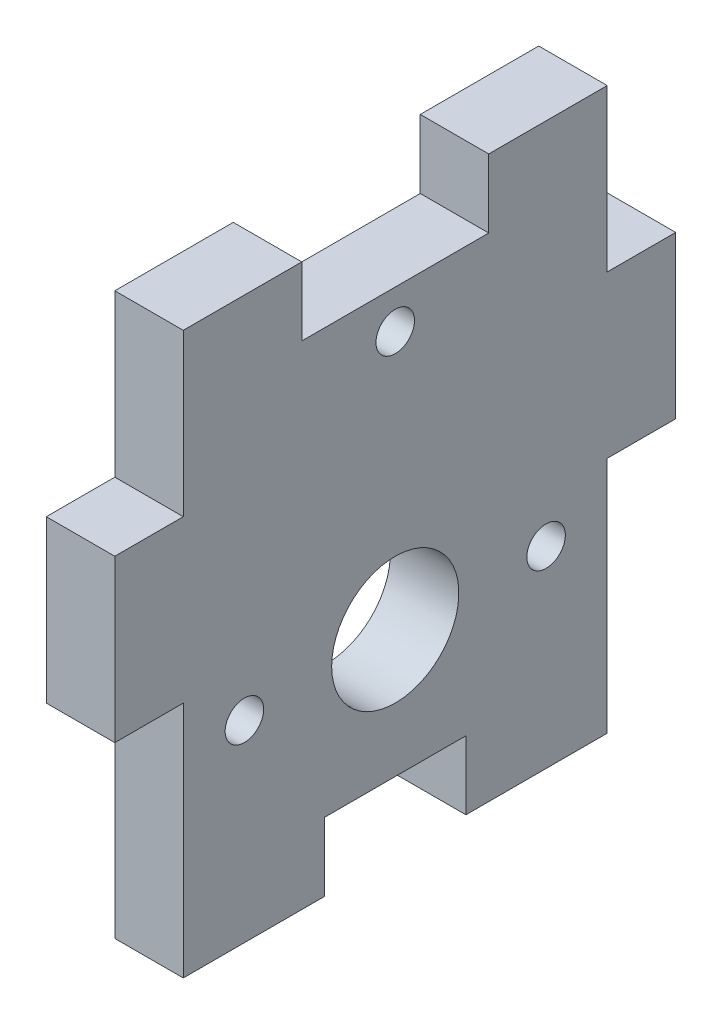
ISO-10303-21;
HEADER;
FILE_DESCRIPTION(('STEP AP214'),'2;1');
FILE_NAME('part.step','',(''),(''),'','','');
FILE_SCHEMA(('AUTOMOTIVE_DESIGN { 1 0 10303 214 1 1 1 1 }'));
ENDSEC;
DATA;
#1=APPLICATION_CONTEXT('core data for automotive mechanical design processes');
#2=APPLICATION_PROTOCOL_DEFINITION('international standard','automotive_design',2000,#1);
#3=PRODUCT_CONTEXT('',#1,'mechanical');
#4=PRODUCT('Part','Part','',(#3));
#5=PRODUCT_RELATED_PRODUCT_CATEGORY('part','',(#4));
#6=PRODUCT_DEFINITION_FORMATION('','',#4);
#7=PRODUCT_DEFINITION_CONTEXT('part definition',#1,'design');
#8=PRODUCT_DEFINITION('design','',#6,#7);
#9=PRODUCT_DEFINITION_SHAPE('','',#8);
#10=(LENGTH_UNIT() NAMED_UNIT(*) SI_UNIT(.MILLI.,.METRE.));
#11=(NAMED_UNIT(*) PLANE_ANGLE_UNIT() SI_UNIT($,.RADIAN.));
#12=(NAMED_UNIT(*) SI_UNIT($,.STERADIAN.) SOLID_ANGLE_UNIT());
#13=UNCERTAINTY_MEASURE_WITH_UNIT(LENGTH_MEASURE(1.E-05),#10,'distance_accuracy_value','');
#14=(GEOMETRIC_REPRESENTATION_CONTEXT(3) GLOBAL_UNCERTAINTY_ASSIGNED_CONTEXT((#13)) GLOBAL_UNIT_ASSIGNED_CONTEXT((#10,
#11,#12)) REPRESENTATION_CONTEXT('',''));
#15=CARTESIAN_POINT('',(0.,0.,0.));
#16=DIRECTION('',(0.,0.,1.));
#17=DIRECTION('',(1.,0.,0.));
#18=AXIS2_PLACEMENT_3D('',#15,#16,#17);
#19=CARTESIAN_POINT('',(5.334,16.51,-16.51));
#20=DIRECTION('',(-1.,0.,0.));
#21=DIRECTION('',(0.,0.,1.));
#22=AXIS2_PLACEMENT_3D('',#19,#20,#21);
#23=PLANE('',#22);
#24=CARTESIAN_POINT('',(5.334,-6.84159698893423,-11.7499999999999));
#25=DIRECTION('',(-1.,0.,0.));
#26=DIRECTION('',(0.,0.,1.));
#27=AXIS2_PLACEMENT_3D('',#24,#25,#26);
#28=CIRCLE('',#27,1.5);
#29=CARTESIAN_POINT('',(5.334,-6.84159698893423,-10.2499999999999));
#30=VERTEX_POINT('',#29);
#31=EDGE_CURVE('E540',#30,#30,#28,.T.);
#32=ORIENTED_EDGE('',*,*,#31,.T.);
#33=EDGE_LOOP('',(#32));
#34=FACE_BOUND('',#33,.T.);
#35=CARTESIAN_POINT('',(5.334,-6.60399999999997,0.));
#36=DIRECTION('',(-1.,0.,0.));
#37=DIRECTION('',(0.,0.,1.));
#38=AXIS2_PLACEMENT_3D('',#35,#36,#37);
#39=CIRCLE('',#38,4.953);
#40=CARTESIAN_POINT('',(5.334,-6.60399999999997,4.95300000000006));
#41=VERTEX_POINT('',#40);
#42=EDGE_CURVE('E544',#41,#41,#39,.T.);
#43=ORIENTED_EDGE('',*,*,#42,.T.);
#44=EDGE_LOOP('',(#43));
#45=FACE_BOUND('',#44,.T.);
#46=CARTESIAN_POINT('',(5.334,-6.84159698893422,11.7500000000001));
#47=DIRECTION('',(-1.,0.,0.));
#48=DIRECTION('',(0.,0.,1.));
#49=AXIS2_PLACEMENT_3D('',#46,#47,#48);
#50=CIRCLE('',#49,1.5);
#51=CARTESIAN_POINT('',(5.334,-6.84159698893422,13.2500000000001));
#52=VERTEX_POINT('',#51);
#53=EDGE_CURVE('E553',#52,#52,#50,.T.);
#54=ORIENTED_EDGE('',*,*,#53,.T.);
#55=EDGE_LOOP('',(#54));
#56=FACE_BOUND('',#55,.T.);
#57=CARTESIAN_POINT('',(5.334,13.5100000000001,0.));
#58=DIRECTION('',(-1.,0.,0.));
#59=DIRECTION('',(0.,0.,1.));
#60=AXIS2_PLACEMENT_3D('',#57,#58,#59);
#61=CIRCLE('',#60,1.5);
#62=CARTESIAN_POINT('',(5.334,13.5100000000001,1.50000000000006));
#63=VERTEX_POINT('',#62);
#64=EDGE_CURVE('E231',#63,#63,#61,.T.);
#65=ORIENTED_EDGE('',*,*,#64,.T.);
#66=EDGE_LOOP('',(#65));
#67=FACE_BOUND('',#66,.T.);
#68=DIRECTION('',(0.,0.,-1.));
#69=VECTOR('',#68,1.);
#70=CARTESIAN_POINT('',(5.33400000000003,16.51,7.28133333333334));
#71=LINE('',#70,#69);
#72=CARTESIAN_POINT('',(5.33400000000003,16.51,7.28133333333334));
#73=VERTEX_POINT('',#72);
#74=CARTESIAN_POINT('',(5.33400000000002,16.51,-7.28133333333333));
#75=VERTEX_POINT('',#74);
#76=EDGE_CURVE('E274',#73,#75,#71,.T.);
#77=ORIENTED_EDGE('',*,*,#76,.F.);
#78=DIRECTION('',(0.,1.,0.));
#79=VECTOR('',#78,1.);
#80=CARTESIAN_POINT('',(5.33400000000003,16.51,7.28133333333334));
#81=LINE('',#80,#79);
#82=CARTESIAN_POINT('',(5.33400000000003,21.844,7.28133333333334));
#83=VERTEX_POINT('',#82);
#84=EDGE_CURVE('E299',#73,#83,#81,.T.);
#85=ORIENTED_EDGE('',*,*,#84,.T.);
#86=DIRECTION('',(0.,0.,1.));
#87=VECTOR('',#86,1.);
#88=CARTESIAN_POINT('',(5.334,21.844,-48.1982213562373));
#89=LINE('',#88,#87);
#90=CARTESIAN_POINT('',(5.334,21.844,16.51));
#91=VERTEX_POINT('',#90);
#92=EDGE_CURVE('E370',#83,#91,#89,.T.);
#93=ORIENTED_EDGE('',*,*,#92,.T.);
#94=DIRECTION('',(0.,1.,0.));
#95=VECTOR('',#94,1.);
#96=CARTESIAN_POINT('',(5.334,-15.875,16.51));
#97=LINE('',#96,#95);
#98=CARTESIAN_POINT('',(5.334,9.271,16.51));
#99=VERTEX_POINT('',#98);
#100=EDGE_CURVE('E89',#99,#91,#97,.T.);
#101=ORIENTED_EDGE('',*,*,#100,.F.);
#102=DIRECTION('',(0.,0.,1.));
#103=VECTOR('',#102,1.);
#104=CARTESIAN_POINT('',(5.334,9.271,16.51));
#105=LINE('',#104,#103);
#106=CARTESIAN_POINT('',(5.334,9.271,21.844));
#107=VERTEX_POINT('',#106);
#108=EDGE_CURVE('E238',#99,#107,#105,.T.);
#109=ORIENTED_EDGE('',*,*,#108,.T.);
#110=DIRECTION('',(0.,1.,0.));
#111=VECTOR('',#110,1.);
#112=CARTESIAN_POINT('',(5.334,0.,21.844));
#113=LINE('',#112,#111);
#114=CARTESIAN_POINT('',(5.334,-3.302,21.844));
#115=VERTEX_POINT('',#114);
#116=EDGE_CURVE('E237',#115,#107,#113,.T.);
#117=ORIENTED_EDGE('',*,*,#116,.F.);
#118=DIRECTION('',(0.,0.,-1.));
#119=VECTOR('',#118,1.);
#120=CARTESIAN_POINT('',(5.334,-3.302,16.51));
#121=LINE('',#120,#119);
#122=CARTESIAN_POINT('',(5.334,-3.302,16.51));
#123=VERTEX_POINT('',#122);
#124=EDGE_CURVE('E226',#115,#123,#121,.T.);
#125=ORIENTED_EDGE('',*,*,#124,.T.);
#126=DIRECTION('',(0.,-1.,0.));
#127=VECTOR('',#126,1.);
#128=CARTESIAN_POINT('',(5.334,0.,16.51));
#129=LINE('',#128,#127);
#130=CARTESIAN_POINT('',(5.334,-21.844,16.51));
#131=VERTEX_POINT('',#130);
#132=EDGE_CURVE('E210',#123,#131,#129,.T.);
#133=ORIENTED_EDGE('',*,*,#132,.T.);
#134=DIRECTION('',(0.,0.,-1.));
#135=VECTOR('',#134,1.);
#136=CARTESIAN_POINT('',(5.334,-21.844,-48.1982213562373));
#137=LINE('',#136,#135);
#138=CARTESIAN_POINT('',(5.334,-21.844,5.50333333333335));
#139=VERTEX_POINT('',#138);
#140=EDGE_CURVE('E330',#131,#139,#137,.T.);
#141=ORIENTED_EDGE('',*,*,#140,.T.);
#142=DIRECTION('',(0.,-1.,0.));
#143=VECTOR('',#142,1.);
#144=CARTESIAN_POINT('',(5.334,-21.844,5.50333333333335));
#145=LINE('',#144,#143);
#146=CARTESIAN_POINT('',(5.334,-16.51,5.50333333333335));
#147=VERTEX_POINT('',#146);
#148=EDGE_CURVE('E307',#147,#139,#145,.T.);
#149=ORIENTED_EDGE('',*,*,#148,.F.);
#150=DIRECTION('',(0.,0.,1.));
#151=VECTOR('',#150,1.);
#152=CARTESIAN_POINT('',(5.334,-16.51,5.50333333333335));
#153=LINE('',#152,#151);
#154=CARTESIAN_POINT('',(5.334,-16.51,-5.50333333333332));
#155=VERTEX_POINT('',#154);
#156=EDGE_CURVE('E312',#155,#147,#153,.T.);
#157=ORIENTED_EDGE('',*,*,#156,.F.);
#158=DIRECTION('',(0.,1.,0.));
#159=VECTOR('',#158,1.);
#160=CARTESIAN_POINT('',(5.334,-21.844,-5.50333333333332));
#161=LINE('',#160,#159);
#162=CARTESIAN_POINT('',(5.334,-21.844,-5.50333333333332));
#163=VERTEX_POINT('',#162);
#164=EDGE_CURVE('E309',#163,#155,#161,.T.);
#165=ORIENTED_EDGE('',*,*,#164,.F.);
#166=CARTESIAN_POINT('',(5.334,-21.844,-16.51));
#167=VERTEX_POINT('',#166);
#168=EDGE_CURVE('E220',#163,#167,#137,.T.);
#169=ORIENTED_EDGE('',*,*,#168,.T.);
#170=DIRECTION('',(0.,-1.,0.));
#171=VECTOR('',#170,1.);
#172=CARTESIAN_POINT('',(5.334,0.,-16.51));
#173=LINE('',#172,#171);
#174=CARTESIAN_POINT('',(5.33399999999999,-3.30200000000001,-16.51));
#175=VERTEX_POINT('',#174);
#176=EDGE_CURVE('E323',#175,#167,#173,.T.);
#177=ORIENTED_EDGE('',*,*,#176,.F.);
#178=DIRECTION('',(0.,0.,-1.));
#179=VECTOR('',#178,1.);
#180=CARTESIAN_POINT('',(5.33399999999999,-3.30200000000001,-21.844));
#181=LINE('',#180,#179);
#182=CARTESIAN_POINT('',(5.33399999999999,-3.30200000000001,-21.844));
#183=VERTEX_POINT('',#182);
#184=EDGE_CURVE('E267',#175,#183,#181,.T.);
#185=ORIENTED_EDGE('',*,*,#184,.T.);
#186=DIRECTION('',(0.,-1.,0.));
#187=VECTOR('',#186,1.);
#188=CARTESIAN_POINT('',(5.334,0.,-21.844));
#189=LINE('',#188,#187);
#190=CARTESIAN_POINT('',(5.334,9.27099999999999,-21.844));
#191=VERTEX_POINT('',#190);
#192=EDGE_CURVE('E332',#191,#183,#189,.T.);
#193=ORIENTED_EDGE('',*,*,#192,.F.);
#194=DIRECTION('',(0.,0.,1.));
#195=VECTOR('',#194,1.);
#196=CARTESIAN_POINT('',(5.33399999999999,9.27099999999999,-21.844));
#197=LINE('',#196,#195);
#198=CARTESIAN_POINT('',(5.33399999999999,9.27099999999999,-16.51));
#199=VERTEX_POINT('',#198);
#200=EDGE_CURVE('E270',#191,#199,#197,.T.);
#201=ORIENTED_EDGE('',*,*,#200,.T.);
#202=DIRECTION('',(0.,1.,0.));
#203=VECTOR('',#202,1.);
#204=CARTESIAN_POINT('',(5.33399999999999,-15.875,-16.51));
#205=LINE('',#204,#203);
#206=CARTESIAN_POINT('',(5.33399999999998,21.844,-16.51));
#207=VERTEX_POINT('',#206);
#208=EDGE_CURVE('E261',#199,#207,#205,.T.);
#209=ORIENTED_EDGE('',*,*,#208,.T.);
#210=CARTESIAN_POINT('',(5.334,21.844,-7.28133333333333));
#211=VERTEX_POINT('',#210);
#212=EDGE_CURVE('E369',#207,#211,#89,.T.);
#213=ORIENTED_EDGE('',*,*,#212,.T.);
#214=DIRECTION('',(0.,1.,0.));
#215=VECTOR('',#214,1.);
#216=CARTESIAN_POINT('',(5.33400000000002,16.51,-7.28133333333333));
#217=LINE('',#216,#215);
#218=EDGE_CURVE('E97',#75,#211,#217,.T.);
#219=ORIENTED_EDGE('',*,*,#218,.F.);
#220=EDGE_LOOP('',(#77,#85,#93,#101,#109,#117,#125,#133,#141,#149,#157,#165,#169,#177,#185,#193,
#201,#209,#213,#219));
#221=FACE_BOUND('',#220,.T.);
#222=ADVANCED_FACE('F73',(#34,#45,#56,#67,#221),#23,.F.);
#223=CARTESIAN_POINT('',(0.,16.51,-16.51));
#224=DIRECTION('',(-1.,0.,0.));
#225=DIRECTION('',(0.,0.,1.));
#226=AXIS2_PLACEMENT_3D('',#223,#224,#225);
#227=PLANE('',#226);
#228=CARTESIAN_POINT('',(0.,-6.84159698893423,-11.7499999999999));
#229=DIRECTION('',(-1.,0.,0.));
#230=DIRECTION('',(0.,0.,1.));
#231=AXIS2_PLACEMENT_3D('',#228,#229,#230);
#232=CIRCLE('',#231,1.5);
#233=CARTESIAN_POINT('',(0.,-6.84159698893423,-10.2499999999999));
#234=VERTEX_POINT('',#233);
#235=EDGE_CURVE('E538',#234,#234,#232,.T.);
#236=ORIENTED_EDGE('',*,*,#235,.F.);
#237=EDGE_LOOP('',(#236));
#238=FACE_BOUND('',#237,.T.);
#239=CARTESIAN_POINT('',(0.,-6.60399999999997,0.));
#240=DIRECTION('',(-1.,0.,0.));
#241=DIRECTION('',(0.,0.,1.));
#242=AXIS2_PLACEMENT_3D('',#239,#240,#241);
#243=CIRCLE('',#242,4.953);
#244=CARTESIAN_POINT('',(0.,-6.60399999999997,4.95300000000006));
#245=VERTEX_POINT('',#244);
#246=EDGE_CURVE('E541',#245,#245,#243,.T.);
#247=ORIENTED_EDGE('',*,*,#246,.F.);
#248=EDGE_LOOP('',(#247));
#249=FACE_BOUND('',#248,.T.);
#250=CARTESIAN_POINT('',(0.,-6.84159698893422,11.7500000000001));
#251=DIRECTION('',(-1.,0.,0.));
#252=DIRECTION('',(0.,0.,1.));
#253=AXIS2_PLACEMENT_3D('',#250,#251,#252);
#254=CIRCLE('',#253,1.5);
#255=CARTESIAN_POINT('',(0.,-6.84159698893422,13.2500000000001));
#256=VERTEX_POINT('',#255);
#257=EDGE_CURVE('E550',#256,#256,#254,.T.);
#258=ORIENTED_EDGE('',*,*,#257,.F.);
#259=EDGE_LOOP('',(#258));
#260=FACE_BOUND('',#259,.T.);
#261=CARTESIAN_POINT('',(0.,13.5100000000001,0.));
#262=DIRECTION('',(-1.,0.,0.));
#263=DIRECTION('',(0.,0.,1.));
#264=AXIS2_PLACEMENT_3D('',#261,#262,#263);
#265=CIRCLE('',#264,1.5);
#266=CARTESIAN_POINT('',(0.,13.5100000000001,1.50000000000006));
#267=VERTEX_POINT('',#266);
#268=EDGE_CURVE('E556',#267,#267,#265,.T.);
#269=ORIENTED_EDGE('',*,*,#268,.F.);
#270=EDGE_LOOP('',(#269));
#271=FACE_BOUND('',#270,.T.);
#272=DIRECTION('',(0.,1.,0.));
#273=VECTOR('',#272,1.);
#274=CARTESIAN_POINT('',(0.,0.,21.844));
#275=LINE('',#274,#273);
#276=CARTESIAN_POINT('',(0.,-3.30200000000001,21.844));
#277=VERTEX_POINT('',#276);
#278=CARTESIAN_POINT('',(0.,9.27099999999999,21.844));
#279=VERTEX_POINT('',#278);
#280=EDGE_CURVE('E342',#277,#279,#275,.T.);
#281=ORIENTED_EDGE('',*,*,#280,.T.);
#282=DIRECTION('',(0.,0.,-1.));
#283=VECTOR('',#282,1.);
#284=CARTESIAN_POINT('',(0.,9.27099999999999,21.84405));
#285=LINE('',#284,#283);
#286=CARTESIAN_POINT('',(0.,9.27099999999999,16.51));
#287=VERTEX_POINT('',#286);
#288=EDGE_CURVE('E421',#279,#287,#285,.T.);
#289=ORIENTED_EDGE('',*,*,#288,.T.);
#290=DIRECTION('',(0.,-1.,0.));
#291=VECTOR('',#290,1.);
#292=CARTESIAN_POINT('',(0.,21.844,16.51));
#293=LINE('',#292,#291);
#294=CARTESIAN_POINT('',(0.,21.844,16.51));
#295=VERTEX_POINT('',#294);
#296=EDGE_CURVE('E287',#295,#287,#293,.T.);
#297=ORIENTED_EDGE('',*,*,#296,.F.);
#298=DIRECTION('',(0.,0.,1.));
#299=VECTOR('',#298,1.);
#300=CARTESIAN_POINT('',(0.,21.844,-48.1982213562373));
#301=LINE('',#300,#299);
#302=CARTESIAN_POINT('',(0.,21.844,7.28133333333334));
#303=VERTEX_POINT('',#302);
#304=EDGE_CURVE('E339',#303,#295,#301,.T.);
#305=ORIENTED_EDGE('',*,*,#304,.F.);
#306=DIRECTION('',(0.,1.,0.));
#307=VECTOR('',#306,1.);
#308=CARTESIAN_POINT('',(0.,16.51,7.28133333333334));
#309=LINE('',#308,#307);
#310=CARTESIAN_POINT('',(0.,16.51,7.28133333333334));
#311=VERTEX_POINT('',#310);
#312=EDGE_CURVE('E284',#311,#303,#309,.T.);
#313=ORIENTED_EDGE('',*,*,#312,.F.);
#314=DIRECTION('',(0.,0.,1.));
#315=VECTOR('',#314,1.);
#316=CARTESIAN_POINT('',(0.,16.51,-16.51));
#317=LINE('',#316,#315);
#318=CARTESIAN_POINT('',(0.,16.51,-7.28133333333333));
#319=VERTEX_POINT('',#318);
#320=EDGE_CURVE('E12',#319,#311,#317,.T.);
#321=ORIENTED_EDGE('',*,*,#320,.F.);
#322=DIRECTION('',(0.,1.,0.));
#323=VECTOR('',#322,1.);
#324=CARTESIAN_POINT('',(0.,16.51,-7.28133333333333));
#325=LINE('',#324,#323);
#326=CARTESIAN_POINT('',(0.,21.844,-7.28133333333333));
#327=VERTEX_POINT('',#326);
#328=EDGE_CURVE('E288',#319,#327,#325,.T.);
#329=ORIENTED_EDGE('',*,*,#328,.T.);
#330=CARTESIAN_POINT('',(0.,21.844,-16.51));
#331=VERTEX_POINT('',#330);
#332=EDGE_CURVE('E347',#331,#327,#301,.T.);
#333=ORIENTED_EDGE('',*,*,#332,.F.);
#334=DIRECTION('',(0.,1.,0.));
#335=VECTOR('',#334,1.);
#336=CARTESIAN_POINT('',(0.,16.51,-16.51));
#337=LINE('',#336,#335);
#338=CARTESIAN_POINT('',(0.,9.27099999999999,-16.51));
#339=VERTEX_POINT('',#338);
#340=EDGE_CURVE('E305',#339,#331,#337,.T.);
#341=ORIENTED_EDGE('',*,*,#340,.F.);
#342=DIRECTION('',(0.,0.,-1.));
#343=VECTOR('',#342,1.);
#344=CARTESIAN_POINT('',(0.,9.27099999999999,-16.50995));
#345=LINE('',#344,#343);
#346=CARTESIAN_POINT('',(0.,9.27099999999999,-21.844));
#347=VERTEX_POINT('',#346);
#348=EDGE_CURVE('E252',#339,#347,#345,.T.);
#349=ORIENTED_EDGE('',*,*,#348,.T.);
#350=DIRECTION('',(0.,-1.,0.));
#351=VECTOR('',#350,1.);
#352=CARTESIAN_POINT('',(0.,0.,-21.844));
#353=LINE('',#352,#351);
#354=CARTESIAN_POINT('',(0.,-3.30200000000001,-21.844));
#355=VERTEX_POINT('',#354);
#356=EDGE_CURVE('E336',#347,#355,#353,.T.);
#357=ORIENTED_EDGE('',*,*,#356,.T.);
#358=DIRECTION('',(0.,0.,-1.));
#359=VECTOR('',#358,1.);
#360=CARTESIAN_POINT('',(0.,-3.30200000000001,-16.50995));
#361=LINE('',#360,#359);
#362=CARTESIAN_POINT('',(0.,-3.30200000000001,-16.51));
#363=VERTEX_POINT('',#362);
#364=EDGE_CURVE('E251',#363,#355,#361,.T.);
#365=ORIENTED_EDGE('',*,*,#364,.F.);
#366=DIRECTION('',(0.,-1.,0.));
#367=VECTOR('',#366,1.);
#368=CARTESIAN_POINT('',(0.,0.,-16.51));
#369=LINE('',#368,#367);
#370=CARTESIAN_POINT('',(0.,-21.844,-16.51));
#371=VERTEX_POINT('',#370);
#372=EDGE_CURVE('E221',#363,#371,#369,.T.);
#373=ORIENTED_EDGE('',*,*,#372,.T.);
#374=DIRECTION('',(0.,0.,-1.));
#375=VECTOR('',#374,1.);
#376=CARTESIAN_POINT('',(0.,-21.844,-48.1982213562373));
#377=LINE('',#376,#375);
#378=CARTESIAN_POINT('',(0.,-21.844,-5.50333333333332));
#379=VERTEX_POINT('',#378);
#380=EDGE_CURVE('E335',#379,#371,#377,.T.);
#381=ORIENTED_EDGE('',*,*,#380,.F.);
#382=DIRECTION('',(0.,-1.,0.));
#383=VECTOR('',#382,1.);
#384=CARTESIAN_POINT('',(0.,16.51,-5.50333333333332));
#385=LINE('',#384,#383);
#386=CARTESIAN_POINT('',(0.,-16.51,-5.50333333333332));
#387=VERTEX_POINT('',#386);
#388=EDGE_CURVE('E318',#387,#379,#385,.T.);
#389=ORIENTED_EDGE('',*,*,#388,.F.);
#390=DIRECTION('',(0.,0.,-1.));
#391=VECTOR('',#390,1.);
#392=CARTESIAN_POINT('',(0.,-16.51,-16.51));
#393=LINE('',#392,#391);
#394=CARTESIAN_POINT('',(0.,-16.51,5.50333333333335));
#395=VERTEX_POINT('',#394);
#396=EDGE_CURVE('E82',#395,#387,#393,.T.);
#397=ORIENTED_EDGE('',*,*,#396,.F.);
#398=DIRECTION('',(0.,1.,0.));
#399=VECTOR('',#398,1.);
#400=CARTESIAN_POINT('',(0.,16.51,5.50333333333335));
#401=LINE('',#400,#399);
#402=CARTESIAN_POINT('',(0.,-21.844,5.50333333333335));
#403=VERTEX_POINT('',#402);
#404=EDGE_CURVE('E321',#403,#395,#401,.T.);
#405=ORIENTED_EDGE('',*,*,#404,.F.);
#406=CARTESIAN_POINT('',(0.,-21.844,16.51));
#407=VERTEX_POINT('',#406);
#408=EDGE_CURVE('E329',#407,#403,#377,.T.);
#409=ORIENTED_EDGE('',*,*,#408,.F.);
#410=DIRECTION('',(0.,-1.,0.));
#411=VECTOR('',#410,1.);
#412=CARTESIAN_POINT('',(0.,0.,16.51));
#413=LINE('',#412,#411);
#414=CARTESIAN_POINT('',(0.,-3.30200000000001,16.51));
#415=VERTEX_POINT('',#414);
#416=EDGE_CURVE('E325',#415,#407,#413,.T.);
#417=ORIENTED_EDGE('',*,*,#416,.F.);
#418=DIRECTION('',(0.,0.,-1.));
#419=VECTOR('',#418,1.);
#420=CARTESIAN_POINT('',(0.,-3.30200000000001,21.84405));
#421=LINE('',#420,#419);
#422=EDGE_CURVE('E229',#277,#415,#421,.T.);
#423=ORIENTED_EDGE('',*,*,#422,.F.);
#424=EDGE_LOOP('',(#281,#289,#297,#305,#313,#321,#329,#333,#341,#349,#357,#365,#373,#381,#389,
#397,#405,#409,#417,#423));
#425=FACE_BOUND('',#424,.T.);
#426=ADVANCED_FACE('F75',(#238,#249,#260,#271,#425),#227,.T.);
#427=CARTESIAN_POINT('',(0.,0.,21.844));
#428=DIRECTION('',(0.,0.,-1.));
#429=DIRECTION('',(-1.,0.,0.));
#430=AXIS2_PLACEMENT_3D('',#427,#428,#429);
#431=PLANE('',#430);
#432=DIRECTION('',(-1.,0.,0.));
#433=VECTOR('',#432,1.);
#434=CARTESIAN_POINT('',(-63.5,9.27099999999997,21.844));
#435=LINE('',#434,#433);
#436=EDGE_CURVE('E427',#107,#279,#435,.T.);
#437=ORIENTED_EDGE('',*,*,#436,.T.);
#438=ORIENTED_EDGE('',*,*,#280,.F.);
#439=DIRECTION('',(1.,0.,0.));
#440=VECTOR('',#439,1.);
#441=CARTESIAN_POINT('',(-63.5,-3.30200000000003,21.844));
#442=LINE('',#441,#440);
#443=EDGE_CURVE('E425',#277,#115,#442,.T.);
#444=ORIENTED_EDGE('',*,*,#443,.T.);
#445=ORIENTED_EDGE('',*,*,#116,.T.);
#446=EDGE_LOOP('',(#437,#438,#444,#445));
#447=FACE_BOUND('',#446,.T.);
#448=ADVANCED_FACE('F432',(#447),#431,.F.);
#449=CARTESIAN_POINT('',(0.,21.844,-48.1982213562373));
#450=DIRECTION('',(0.,1.,0.));
#451=DIRECTION('',(0.,0.,1.));
#452=AXIS2_PLACEMENT_3D('',#449,#450,#451);
#453=PLANE('',#452);
#454=DIRECTION('',(1.,0.,0.));
#455=VECTOR('',#454,1.);
#456=CARTESIAN_POINT('',(0.,21.844,7.28133333333334));
#457=LINE('',#456,#455);
#458=EDGE_CURVE('E273',#303,#83,#457,.T.);
#459=ORIENTED_EDGE('',*,*,#458,.F.);
#460=ORIENTED_EDGE('',*,*,#304,.T.);
#461=DIRECTION('',(-1.,0.,0.));
#462=VECTOR('',#461,1.);
#463=CARTESIAN_POINT('',(0.,21.844,16.51));
#464=LINE('',#463,#462);
#465=EDGE_CURVE('E239',#91,#295,#464,.T.);
#466=ORIENTED_EDGE('',*,*,#465,.F.);
#467=ORIENTED_EDGE('',*,*,#92,.F.);
#468=EDGE_LOOP('',(#459,#460,#466,#467));
#469=FACE_BOUND('',#468,.T.);
#470=ADVANCED_FACE('F434',(#469),#453,.T.);
#471=DIRECTION('',(-1.,0.,0.));
#472=VECTOR('',#471,1.);
#473=CARTESIAN_POINT('',(0.,21.844,-7.28133333333333));
#474=LINE('',#473,#472);
#475=EDGE_CURVE('E293',#211,#327,#474,.T.);
#476=ORIENTED_EDGE('',*,*,#475,.F.);
#477=ORIENTED_EDGE('',*,*,#212,.F.);
#478=DIRECTION('',(-1.,0.,0.));
#479=VECTOR('',#478,1.);
#480=CARTESIAN_POINT('',(0.,21.844,-16.51));
#481=LINE('',#480,#479);
#482=EDGE_CURVE('E264',#207,#331,#481,.T.);
#483=ORIENTED_EDGE('',*,*,#482,.T.);
#484=ORIENTED_EDGE('',*,*,#332,.T.);
#485=EDGE_LOOP('',(#476,#477,#483,#484));
#486=FACE_BOUND('',#485,.T.);
#487=ADVANCED_FACE('F397',(#486),#453,.T.);
#488=CARTESIAN_POINT('',(0.,0.,-21.844));
#489=DIRECTION('',(0.,0.,1.));
#490=DIRECTION('',(0.,-1.,0.));
#491=AXIS2_PLACEMENT_3D('',#488,#489,#490);
#492=PLANE('',#491);
#493=DIRECTION('',(1.,0.,0.));
#494=VECTOR('',#493,1.);
#495=CARTESIAN_POINT('',(5.33399999999999,9.27099999999999,-21.844));
#496=LINE('',#495,#494);
#497=EDGE_CURVE('E248',#347,#191,#496,.T.);
#498=ORIENTED_EDGE('',*,*,#497,.T.);
#499=ORIENTED_EDGE('',*,*,#192,.T.);
#500=DIRECTION('',(-1.,0.,0.));
#501=VECTOR('',#500,1.);
#502=CARTESIAN_POINT('',(5.33399999999999,-3.30200000000001,-21.844));
#503=LINE('',#502,#501);
#504=EDGE_CURVE('E241',#183,#355,#503,.T.);
#505=ORIENTED_EDGE('',*,*,#504,.T.);
#506=ORIENTED_EDGE('',*,*,#356,.F.);
#507=EDGE_LOOP('',(#498,#499,#505,#506));
#508=FACE_BOUND('',#507,.T.);
#509=ADVANCED_FACE('F375',(#508),#492,.F.);
#510=CARTESIAN_POINT('',(0.,-21.844,-48.1982213562373));
#511=DIRECTION('',(0.,-1.,0.));
#512=DIRECTION('',(0.,0.,-1.));
#513=AXIS2_PLACEMENT_3D('',#510,#511,#512);
#514=PLANE('',#513);
#515=DIRECTION('',(-1.,0.,0.));
#516=VECTOR('',#515,1.);
#517=CARTESIAN_POINT('',(0.,-21.844,5.50333333333335));
#518=LINE('',#517,#516);
#519=EDGE_CURVE('E351',#139,#403,#518,.T.);
#520=ORIENTED_EDGE('',*,*,#519,.F.);
#521=ORIENTED_EDGE('',*,*,#140,.F.);
#522=DIRECTION('',(1.,0.,0.));
#523=VECTOR('',#522,1.);
#524=CARTESIAN_POINT('',(0.,-21.844,16.51));
#525=LINE('',#524,#523);
#526=EDGE_CURVE('E215',#407,#131,#525,.T.);
#527=ORIENTED_EDGE('',*,*,#526,.F.);
#528=ORIENTED_EDGE('',*,*,#408,.T.);
#529=EDGE_LOOP('',(#520,#521,#527,#528));
#530=FACE_BOUND('',#529,.T.);
#531=ADVANCED_FACE('F453',(#530),#514,.T.);
#532=CARTESIAN_POINT('',(0.,0.,-16.51));
#533=DIRECTION('',(0.,0.,1.));
#534=DIRECTION('',(1.,0.,0.));
#535=AXIS2_PLACEMENT_3D('',#532,#533,#534);
#536=PLANE('',#535);
#537=ORIENTED_EDGE('',*,*,#176,.T.);
#538=DIRECTION('',(1.,0.,0.));
#539=VECTOR('',#538,1.);
#540=CARTESIAN_POINT('',(0.,-21.844,-16.51));
#541=LINE('',#540,#539);
#542=EDGE_CURVE('E326',#371,#167,#541,.T.);
#543=ORIENTED_EDGE('',*,*,#542,.F.);
#544=ORIENTED_EDGE('',*,*,#372,.F.);
#545=DIRECTION('',(1.,0.,0.));
#546=VECTOR('',#545,1.);
#547=CARTESIAN_POINT('',(-63.5,-3.30200000000002,-16.51));
#548=LINE('',#547,#546);
#549=EDGE_CURVE('E255',#363,#175,#548,.T.);
#550=ORIENTED_EDGE('',*,*,#549,.T.);
#551=EDGE_LOOP('',(#537,#543,#544,#550));
#552=FACE_BOUND('',#551,.T.);
#553=ADVANCED_FACE('F458',(#552),#536,.F.);
#554=DIRECTION('',(1.,0.,0.));
#555=VECTOR('',#554,1.);
#556=CARTESIAN_POINT('',(0.,-21.844,-5.50333333333332));
#557=LINE('',#556,#555);
#558=EDGE_CURVE('E353',#379,#163,#557,.T.);
#559=ORIENTED_EDGE('',*,*,#558,.F.);
#560=ORIENTED_EDGE('',*,*,#380,.T.);
#561=ORIENTED_EDGE('',*,*,#542,.T.);
#562=ORIENTED_EDGE('',*,*,#168,.F.);
#563=EDGE_LOOP('',(#559,#560,#561,#562));
#564=FACE_BOUND('',#563,.T.);
#565=ADVANCED_FACE('F461',(#564),#514,.T.);
#566=CARTESIAN_POINT('',(0.,0.,16.51));
#567=DIRECTION('',(0.,0.,1.));
#568=DIRECTION('',(1.,0.,0.));
#569=AXIS2_PLACEMENT_3D('',#566,#567,#568);
#570=PLANE('',#569);
#571=ORIENTED_EDGE('',*,*,#132,.F.);
#572=DIRECTION('',(-1.,0.,0.));
#573=VECTOR('',#572,1.);
#574=CARTESIAN_POINT('',(5.334,-3.302,16.51));
#575=LINE('',#574,#573);
#576=EDGE_CURVE('E214',#123,#415,#575,.T.);
#577=ORIENTED_EDGE('',*,*,#576,.T.);
#578=ORIENTED_EDGE('',*,*,#416,.T.);
#579=ORIENTED_EDGE('',*,*,#526,.T.);
#580=EDGE_LOOP('',(#571,#577,#578,#579));
#581=FACE_BOUND('',#580,.T.);
#582=ADVANCED_FACE('F212',(#581),#570,.T.);
#583=CARTESIAN_POINT('',(-4.99999999997031E-05,-21.844,5.50333333333335));
#584=DIRECTION('',(0.,0.,1.));
#585=DIRECTION('',(1.,0.,0.));
#586=AXIS2_PLACEMENT_3D('',#583,#584,#585);
#587=PLANE('',#586);
#588=ORIENTED_EDGE('',*,*,#404,.T.);
#589=DIRECTION('',(1.,0.,0.));
#590=VECTOR('',#589,1.);
#591=CARTESIAN_POINT('',(-4.99999999997031E-05,-16.51,5.50333333333335));
#592=LINE('',#591,#590);
#593=EDGE_CURVE('E316',#395,#147,#592,.T.);
#594=ORIENTED_EDGE('',*,*,#593,.T.);
#595=ORIENTED_EDGE('',*,*,#148,.T.);
#596=ORIENTED_EDGE('',*,*,#519,.T.);
#597=EDGE_LOOP('',(#588,#594,#595,#596));
#598=FACE_BOUND('',#597,.T.);
#599=ADVANCED_FACE('F475',(#598),#587,.F.);
#600=CARTESIAN_POINT('',(-4.99999999997031E-05,-16.51,5.50333333333335));
#601=DIRECTION('',(0.,1.,0.));
#602=DIRECTION('',(0.,0.,1.));
#603=AXIS2_PLACEMENT_3D('',#600,#601,#602);
#604=PLANE('',#603);
#605=ORIENTED_EDGE('',*,*,#396,.T.);
#606=DIRECTION('',(1.,0.,0.));
#607=VECTOR('',#606,1.);
#608=CARTESIAN_POINT('',(-4.99999999997031E-05,-16.51,-5.50333333333332));
#609=LINE('',#608,#607);
#610=EDGE_CURVE('E315',#387,#155,#609,.T.);
#611=ORIENTED_EDGE('',*,*,#610,.T.);
#612=ORIENTED_EDGE('',*,*,#156,.T.);
#613=ORIENTED_EDGE('',*,*,#593,.F.);
#614=EDGE_LOOP('',(#605,#611,#612,#613));
#615=FACE_BOUND('',#614,.T.);
#616=ADVANCED_FACE('F487',(#615),#604,.F.);
#617=CARTESIAN_POINT('',(-4.99999999997031E-05,-21.844,-5.50333333333332));
#618=DIRECTION('',(0.,0.,-1.));
#619=DIRECTION('',(-1.,0.,0.));
#620=AXIS2_PLACEMENT_3D('',#617,#618,#619);
#621=PLANE('',#620);
#622=ORIENTED_EDGE('',*,*,#388,.T.);
#623=ORIENTED_EDGE('',*,*,#558,.T.);
#624=ORIENTED_EDGE('',*,*,#164,.T.);
#625=ORIENTED_EDGE('',*,*,#610,.F.);
#626=EDGE_LOOP('',(#622,#623,#624,#625));
#627=FACE_BOUND('',#626,.T.);
#628=ADVANCED_FACE('F484',(#627),#621,.F.);
#629=CARTESIAN_POINT('',(5.334,-3.302,21.84405));
#630=DIRECTION('',(0.,-1.,0.));
#631=DIRECTION('',(-1.,0.,0.));
#632=AXIS2_PLACEMENT_3D('',#629,#630,#631);
#633=PLANE('',#632);
#634=ORIENTED_EDGE('',*,*,#443,.F.);
#635=ORIENTED_EDGE('',*,*,#422,.T.);
#636=ORIENTED_EDGE('',*,*,#576,.F.);
#637=ORIENTED_EDGE('',*,*,#124,.F.);
#638=EDGE_LOOP('',(#634,#635,#636,#637));
#639=FACE_BOUND('',#638,.T.);
#640=ADVANCED_FACE('F225',(#639),#633,.T.);
#641=CARTESIAN_POINT('',(5.33399999999999,-3.30200000000001,-16.50995));
#642=DIRECTION('',(0.,-1.,0.));
#643=DIRECTION('',(-1.,0.,0.));
#644=AXIS2_PLACEMENT_3D('',#641,#642,#643);
#645=PLANE('',#644);
#646=ORIENTED_EDGE('',*,*,#549,.F.);
#647=ORIENTED_EDGE('',*,*,#364,.T.);
#648=ORIENTED_EDGE('',*,*,#504,.F.);
#649=ORIENTED_EDGE('',*,*,#184,.F.);
#650=EDGE_LOOP('',(#646,#647,#648,#649));
#651=FACE_BOUND('',#650,.T.);
#652=ADVANCED_FACE('F380',(#651),#645,.T.);
#653=CARTESIAN_POINT('',(5.33399999999999,9.27099999999999,-16.50995));
#654=DIRECTION('',(0.,1.,0.));
#655=DIRECTION('',(1.,0.,0.));
#656=AXIS2_PLACEMENT_3D('',#653,#654,#655);
#657=PLANE('',#656);
#658=DIRECTION('',(-1.,0.,0.));
#659=VECTOR('',#658,1.);
#660=CARTESIAN_POINT('',(-63.5,9.27099999999998,-16.51));
#661=LINE('',#660,#659);
#662=EDGE_CURVE('E259',#199,#339,#661,.T.);
#663=ORIENTED_EDGE('',*,*,#662,.F.);
#664=ORIENTED_EDGE('',*,*,#200,.F.);
#665=ORIENTED_EDGE('',*,*,#497,.F.);
#666=ORIENTED_EDGE('',*,*,#348,.F.);
#667=EDGE_LOOP('',(#663,#664,#665,#666));
#668=FACE_BOUND('',#667,.T.);
#669=ADVANCED_FACE('F390',(#668),#657,.T.);
#670=CARTESIAN_POINT('',(-63.5,16.51,-16.51));
#671=DIRECTION('',(0.,0.,1.));
#672=DIRECTION('',(1.,0.,0.));
#673=AXIS2_PLACEMENT_3D('',#670,#671,#672);
#674=PLANE('',#673);
#675=ORIENTED_EDGE('',*,*,#340,.T.);
#676=ORIENTED_EDGE('',*,*,#482,.F.);
#677=ORIENTED_EDGE('',*,*,#208,.F.);
#678=ORIENTED_EDGE('',*,*,#662,.T.);
#679=EDGE_LOOP('',(#675,#676,#677,#678));
#680=FACE_BOUND('',#679,.T.);
#681=ADVANCED_FACE('F393',(#680),#674,.F.);
#682=CARTESIAN_POINT('',(-63.5,16.51,16.51));
#683=DIRECTION('',(0.,0.,1.));
#684=DIRECTION('',(1.,0.,0.));
#685=AXIS2_PLACEMENT_3D('',#682,#683,#684);
#686=PLANE('',#685);
#687=DIRECTION('',(1.,0.,0.));
#688=VECTOR('',#687,1.);
#689=CARTESIAN_POINT('',(5.334,9.271,16.51));
#690=LINE('',#689,#688);
#691=EDGE_CURVE('E230',#287,#99,#690,.T.);
#692=ORIENTED_EDGE('',*,*,#691,.T.);
#693=ORIENTED_EDGE('',*,*,#100,.T.);
#694=ORIENTED_EDGE('',*,*,#465,.T.);
#695=ORIENTED_EDGE('',*,*,#296,.T.);
#696=EDGE_LOOP('',(#692,#693,#694,#695));
#697=FACE_BOUND('',#696,.T.);
#698=ADVANCED_FACE('F415',(#697),#686,.T.);
#699=CARTESIAN_POINT('',(5.334,9.271,21.84405));
#700=DIRECTION('',(0.,1.,0.));
#701=DIRECTION('',(1.,0.,0.));
#702=AXIS2_PLACEMENT_3D('',#699,#700,#701);
#703=PLANE('',#702);
#704=ORIENTED_EDGE('',*,*,#436,.F.);
#705=ORIENTED_EDGE('',*,*,#108,.F.);
#706=ORIENTED_EDGE('',*,*,#691,.F.);
#707=ORIENTED_EDGE('',*,*,#288,.F.);
#708=EDGE_LOOP('',(#704,#705,#706,#707));
#709=FACE_BOUND('',#708,.T.);
#710=ADVANCED_FACE('F420',(#709),#703,.T.);
#711=CARTESIAN_POINT('',(-38.1,16.51,-16.51));
#712=DIRECTION('',(0.,-1.,0.));
#713=DIRECTION('',(-1.,0.,0.));
#714=AXIS2_PLACEMENT_3D('',#711,#712,#713);
#715=PLANE('',#714);
#716=ORIENTED_EDGE('',*,*,#320,.T.);
#717=DIRECTION('',(1.,0.,0.));
#718=VECTOR('',#717,1.);
#719=CARTESIAN_POINT('',(0.,16.51,7.28133333333334));
#720=LINE('',#719,#718);
#721=EDGE_CURVE('E278',#311,#73,#720,.T.);
#722=ORIENTED_EDGE('',*,*,#721,.T.);
#723=ORIENTED_EDGE('',*,*,#76,.T.);
#724=DIRECTION('',(-1.,0.,0.));
#725=VECTOR('',#724,1.);
#726=CARTESIAN_POINT('',(0.,16.51,-7.28133333333333));
#727=LINE('',#726,#725);
#728=EDGE_CURVE('E277',#75,#319,#727,.T.);
#729=ORIENTED_EDGE('',*,*,#728,.T.);
#730=EDGE_LOOP('',(#716,#722,#723,#729));
#731=FACE_BOUND('',#730,.T.);
#732=ADVANCED_FACE('F405',(#731),#715,.F.);
#733=CARTESIAN_POINT('',(0.,16.51,7.28133333333334));
#734=DIRECTION('',(0.,0.,1.));
#735=DIRECTION('',(1.,0.,0.));
#736=AXIS2_PLACEMENT_3D('',#733,#734,#735);
#737=PLANE('',#736);
#738=ORIENTED_EDGE('',*,*,#458,.T.);
#739=ORIENTED_EDGE('',*,*,#84,.F.);
#740=ORIENTED_EDGE('',*,*,#721,.F.);
#741=ORIENTED_EDGE('',*,*,#312,.T.);
#742=EDGE_LOOP('',(#738,#739,#740,#741));
#743=FACE_BOUND('',#742,.T.);
#744=ADVANCED_FACE('F407',(#743),#737,.F.);
#745=CARTESIAN_POINT('',(0.,16.51,-7.28133333333333));
#746=DIRECTION('',(0.,0.,-1.));
#747=DIRECTION('',(-1.,0.,0.));
#748=AXIS2_PLACEMENT_3D('',#745,#746,#747);
#749=PLANE('',#748);
#750=ORIENTED_EDGE('',*,*,#475,.T.);
#751=ORIENTED_EDGE('',*,*,#328,.F.);
#752=ORIENTED_EDGE('',*,*,#728,.F.);
#753=ORIENTED_EDGE('',*,*,#218,.T.);
#754=EDGE_LOOP('',(#750,#751,#752,#753));
#755=FACE_BOUND('',#754,.T.);
#756=ADVANCED_FACE('F399',(#755),#749,.F.);
#757=CARTESIAN_POINT('',(5.33402500000003,13.5100000000001,0.));
#758=DIRECTION('',(-1.,0.,0.));
#759=DIRECTION('',(0.,0.,1.));
#760=AXIS2_PLACEMENT_3D('',#757,#758,#759);
#761=CYLINDRICAL_SURFACE('',#760,1.5);
#762=ORIENTED_EDGE('',*,*,#268,.T.);
#763=EDGE_LOOP('',(#762));
#764=FACE_BOUND('',#763,.T.);
#765=ORIENTED_EDGE('',*,*,#64,.F.);
#766=EDGE_LOOP('',(#765));
#767=FACE_BOUND('',#766,.T.);
#768=ADVANCED_FACE('F506',(#764,#767),#761,.F.);
#769=CARTESIAN_POINT('',(5.33402500000003,-6.84159698893422,11.7500000000001));
#770=DIRECTION('',(-1.,0.,0.));
#771=DIRECTION('',(0.,0.,1.));
#772=AXIS2_PLACEMENT_3D('',#769,#770,#771);
#773=CYLINDRICAL_SURFACE('',#772,1.5);
#774=ORIENTED_EDGE('',*,*,#257,.T.);
#775=EDGE_LOOP('',(#774));
#776=FACE_BOUND('',#775,.T.);
#777=ORIENTED_EDGE('',*,*,#53,.F.);
#778=EDGE_LOOP('',(#777));
#779=FACE_BOUND('',#778,.T.);
#780=ADVANCED_FACE('F521',(#776,#779),#773,.F.);
#781=CARTESIAN_POINT('',(5.33402500000003,-6.60399999999997,0.));
#782=DIRECTION('',(-1.,0.,0.));
#783=DIRECTION('',(0.,0.,1.));
#784=AXIS2_PLACEMENT_3D('',#781,#782,#783);
#785=CYLINDRICAL_SURFACE('',#784,4.953);
#786=ORIENTED_EDGE('',*,*,#246,.T.);
#787=EDGE_LOOP('',(#786));
#788=FACE_BOUND('',#787,.T.);
#789=ORIENTED_EDGE('',*,*,#42,.F.);
#790=EDGE_LOOP('',(#789));
#791=FACE_BOUND('',#790,.T.);
#792=ADVANCED_FACE('F525',(#788,#791),#785,.F.);
#793=CARTESIAN_POINT('',(5.33402500000003,-6.84159698893423,-11.7499999999999));
#794=DIRECTION('',(-1.,0.,0.));
#795=DIRECTION('',(0.,0.,1.));
#796=AXIS2_PLACEMENT_3D('',#793,#794,#795);
#797=CYLINDRICAL_SURFACE('',#796,1.5);
#798=ORIENTED_EDGE('',*,*,#235,.T.);
#799=EDGE_LOOP('',(#798));
#800=FACE_BOUND('',#799,.T.);
#801=ORIENTED_EDGE('',*,*,#31,.F.);
#802=EDGE_LOOP('',(#801));
#803=FACE_BOUND('',#802,.T.);
#804=ADVANCED_FACE('F529',(#800,#803),#797,.F.);
#805=CLOSED_SHELL('',(#222,#426,#448,#470,#487,#509,#531,#553,#565,#582,#599,#616,#628,#640,
#652,#669,#681,#698,#710,#732,#744,#756,#768,#780,#792,#804));
#806=MANIFOLD_SOLID_BREP('B2',#805);
#807=ADVANCED_BREP_SHAPE_REPRESENTATION('',(#18,#806),#14);
#808=SHAPE_DEFINITION_REPRESENTATION(#9,#807);
ENDSEC;
END-ISO-10303-21;
